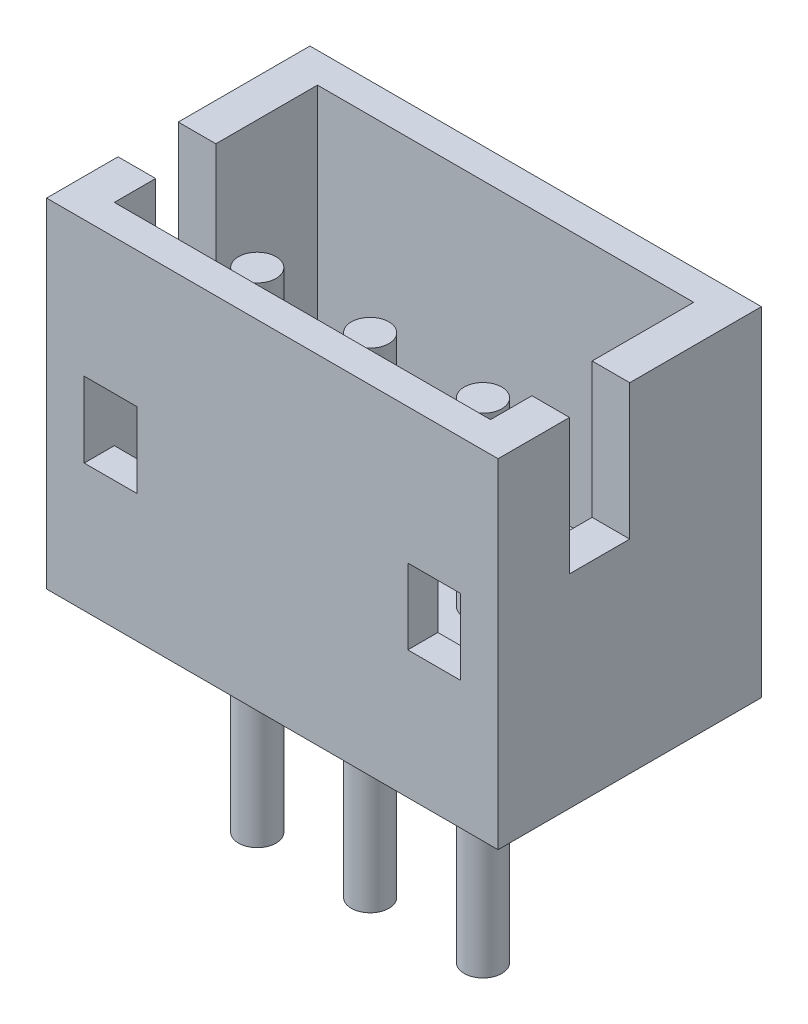
ISO-10303-21;
HEADER;
FILE_DESCRIPTION(('STEP AP214'),'2;1');
FILE_NAME('part.step','',(''),(''),'','','');
FILE_SCHEMA(('AUTOMOTIVE_DESIGN { 1 0 10303 214 1 1 1 1 }'));
ENDSEC;
DATA;
#1=APPLICATION_CONTEXT('core data for automotive mechanical design processes');
#2=APPLICATION_PROTOCOL_DEFINITION('international standard','automotive_design',2000,#1);
#3=PRODUCT_CONTEXT('',#1,'mechanical');
#4=PRODUCT('Part','Part','',(#3));
#5=PRODUCT_RELATED_PRODUCT_CATEGORY('part','',(#4));
#6=PRODUCT_DEFINITION_FORMATION('','',#4);
#7=PRODUCT_DEFINITION_CONTEXT('part definition',#1,'design');
#8=PRODUCT_DEFINITION('design','',#6,#7);
#9=PRODUCT_DEFINITION_SHAPE('','',#8);
#10=(LENGTH_UNIT() NAMED_UNIT(*) SI_UNIT(.MILLI.,.METRE.));
#11=(NAMED_UNIT(*) PLANE_ANGLE_UNIT() SI_UNIT($,.RADIAN.));
#12=(NAMED_UNIT(*) SI_UNIT($,.STERADIAN.) SOLID_ANGLE_UNIT());
#13=UNCERTAINTY_MEASURE_WITH_UNIT(LENGTH_MEASURE(1.E-05),#10,'distance_accuracy_value','');
#14=(GEOMETRIC_REPRESENTATION_CONTEXT(3) GLOBAL_UNCERTAINTY_ASSIGNED_CONTEXT((#13)) GLOBAL_UNIT_ASSIGNED_CONTEXT((#10,
#11,#12)) REPRESENTATION_CONTEXT('',''));
#15=CARTESIAN_POINT('',(0.,0.,0.));
#16=DIRECTION('',(0.,0.,1.));
#17=DIRECTION('',(1.,0.,0.));
#18=AXIS2_PLACEMENT_3D('',#15,#16,#17);
#19=CARTESIAN_POINT('',(1.8,4.5,-0.4));
#20=DIRECTION('',(0.,1.,0.));
#21=DIRECTION('',(0.,0.,1.));
#22=AXIS2_PLACEMENT_3D('',#19,#20,#21);
#23=PLANE('',#22);
#24=DIRECTION('',(-1.,0.,0.));
#25=VECTOR('',#24,1.);
#26=CARTESIAN_POINT('',(3.,4.5,-0.95));
#27=LINE('',#26,#25);
#28=CARTESIAN_POINT('',(-2.5,4.5,-0.95));
#29=VERTEX_POINT('',#28);
#30=CARTESIAN_POINT('',(-3.,4.5,-0.95));
#31=VERTEX_POINT('',#30);
#32=EDGE_CURVE('E210',#29,#31,#27,.T.);
#33=ORIENTED_EDGE('',*,*,#32,.T.);
#34=DIRECTION('',(0.,0.,-1.));
#35=VECTOR('',#34,1.);
#36=CARTESIAN_POINT('',(-3.,4.5,-3.1));
#37=LINE('',#36,#35);
#38=CARTESIAN_POINT('',(-3.,4.5,0.));
#39=VERTEX_POINT('',#38);
#40=EDGE_CURVE('E225',#39,#31,#37,.T.);
#41=ORIENTED_EDGE('',*,*,#40,.F.);
#42=DIRECTION('',(-1.,0.,0.));
#43=VECTOR('',#42,1.);
#44=CARTESIAN_POINT('',(1.8,4.5,0.));
#45=LINE('',#44,#43);
#46=CARTESIAN_POINT('',(3.,4.5,0.));
#47=VERTEX_POINT('',#46);
#48=EDGE_CURVE('E320',#47,#39,#45,.T.);
#49=ORIENTED_EDGE('',*,*,#48,.F.);
#50=DIRECTION('',(0.,0.,1.));
#51=VECTOR('',#50,1.);
#52=CARTESIAN_POINT('',(3.,4.5,0.));
#53=LINE('',#52,#51);
#54=CARTESIAN_POINT('',(3.,4.5,-0.95));
#55=VERTEX_POINT('',#54);
#56=EDGE_CURVE('E266',#55,#47,#53,.T.);
#57=ORIENTED_EDGE('',*,*,#56,.F.);
#58=DIRECTION('',(1.,0.,0.));
#59=VECTOR('',#58,1.);
#60=CARTESIAN_POINT('',(-3.001,4.5,-0.95));
#61=LINE('',#60,#59);
#62=CARTESIAN_POINT('',(2.5,4.5,-0.95));
#63=VERTEX_POINT('',#62);
#64=EDGE_CURVE('E56',#63,#55,#61,.T.);
#65=ORIENTED_EDGE('',*,*,#64,.F.);
#66=DIRECTION('',(0.,0.,1.));
#67=VECTOR('',#66,1.);
#68=CARTESIAN_POINT('',(2.5,4.5,0.));
#69=LINE('',#68,#67);
#70=CARTESIAN_POINT('',(2.5,4.5,-0.400000000000001));
#71=VERTEX_POINT('',#70);
#72=EDGE_CURVE('E274',#63,#71,#69,.T.);
#73=ORIENTED_EDGE('',*,*,#72,.T.);
#74=DIRECTION('',(-1.,0.,0.));
#75=VECTOR('',#74,1.);
#76=CARTESIAN_POINT('',(1.8,4.5,-0.4));
#77=LINE('',#76,#75);
#78=CARTESIAN_POINT('',(-2.5,4.5,-0.4));
#79=VERTEX_POINT('',#78);
#80=EDGE_CURVE('E312',#71,#79,#77,.T.);
#81=ORIENTED_EDGE('',*,*,#80,.T.);
#82=DIRECTION('',(0.,0.,-1.));
#83=VECTOR('',#82,1.);
#84=CARTESIAN_POINT('',(-2.5,4.5,-3.1));
#85=LINE('',#84,#83);
#86=EDGE_CURVE('E228',#79,#29,#85,.T.);
#87=ORIENTED_EDGE('',*,*,#86,.T.);
#88=EDGE_LOOP('',(#33,#41,#49,#57,#65,#73,#81,#87));
#89=FACE_BOUND('',#88,.T.);
#90=ADVANCED_FACE('F33',(#89),#23,.T.);
#91=CARTESIAN_POINT('',(0.,0.,-0.4));
#92=DIRECTION('',(0.,0.,1.));
#93=DIRECTION('',(1.,0.,0.));
#94=AXIS2_PLACEMENT_3D('',#91,#92,#93);
#95=PLANE('',#94);
#96=DIRECTION('',(1.,0.,0.));
#97=VECTOR('',#96,1.);
#98=CARTESIAN_POINT('',(-2.5,1.4,-0.4));
#99=LINE('',#98,#97);
#100=CARTESIAN_POINT('',(-2.5,1.4,-0.4));
#101=VERTEX_POINT('',#100);
#102=CARTESIAN_POINT('',(2.5,1.4,-0.4));
#103=VERTEX_POINT('',#102);
#104=EDGE_CURVE('E427',#101,#103,#99,.T.);
#105=ORIENTED_EDGE('',*,*,#104,.F.);
#106=DIRECTION('',(0.,1.,0.));
#107=VECTOR('',#106,1.);
#108=CARTESIAN_POINT('',(-2.5,1.1,-0.4));
#109=LINE('',#108,#107);
#110=CARTESIAN_POINT('',(-2.5,1.7,-0.4));
#111=VERTEX_POINT('',#110);
#112=EDGE_CURVE('E345',#101,#111,#109,.T.);
#113=ORIENTED_EDGE('',*,*,#112,.T.);
#114=DIRECTION('',(1.,0.,0.));
#115=VECTOR('',#114,1.);
#116=CARTESIAN_POINT('',(-2.5,1.7,-0.4));
#117=LINE('',#116,#115);
#118=CARTESIAN_POINT('',(-1.8,1.7,-0.4));
#119=VERTEX_POINT('',#118);
#120=EDGE_CURVE('E334',#111,#119,#117,.T.);
#121=ORIENTED_EDGE('',*,*,#120,.T.);
#122=DIRECTION('',(0.,-1.,0.));
#123=VECTOR('',#122,1.);
#124=CARTESIAN_POINT('',(-1.8,4.5,-0.4));
#125=LINE('',#124,#123);
#126=CARTESIAN_POINT('',(-1.8,2.7,-0.4));
#127=VERTEX_POINT('',#126);
#128=EDGE_CURVE('E315',#127,#119,#125,.T.);
#129=ORIENTED_EDGE('',*,*,#128,.F.);
#130=DIRECTION('',(1.,0.,0.));
#131=VECTOR('',#130,1.);
#132=CARTESIAN_POINT('',(-2.5,2.7,-0.4));
#133=LINE('',#132,#131);
#134=CARTESIAN_POINT('',(-2.5,2.7,-0.4));
#135=VERTEX_POINT('',#134);
#136=EDGE_CURVE('E301',#135,#127,#133,.T.);
#137=ORIENTED_EDGE('',*,*,#136,.F.);
#138=DIRECTION('',(0.,-1.,0.));
#139=VECTOR('',#138,1.);
#140=CARTESIAN_POINT('',(-2.5,2.7,-0.4));
#141=LINE('',#140,#139);
#142=EDGE_CURVE('E298',#79,#135,#141,.T.);
#143=ORIENTED_EDGE('',*,*,#142,.F.);
#144=ORIENTED_EDGE('',*,*,#80,.F.);
#145=DIRECTION('',(0.,1.,0.));
#146=VECTOR('',#145,1.);
#147=CARTESIAN_POINT('',(2.5,4.5,-0.400000000000001));
#148=LINE('',#147,#146);
#149=CARTESIAN_POINT('',(2.5,2.7,-0.400000000000001));
#150=VERTEX_POINT('',#149);
#151=EDGE_CURVE('E283',#150,#71,#148,.T.);
#152=ORIENTED_EDGE('',*,*,#151,.F.);
#153=DIRECTION('',(-1.,0.,0.));
#154=VECTOR('',#153,1.);
#155=CARTESIAN_POINT('',(2.5,2.7,-0.400000000000001));
#156=LINE('',#155,#154);
#157=CARTESIAN_POINT('',(1.8,2.7,-0.400000000000001));
#158=VERTEX_POINT('',#157);
#159=EDGE_CURVE('E286',#150,#158,#156,.T.);
#160=ORIENTED_EDGE('',*,*,#159,.T.);
#161=DIRECTION('',(0.,1.,0.));
#162=VECTOR('',#161,1.);
#163=CARTESIAN_POINT('',(1.8,1.7,-0.4));
#164=LINE('',#163,#162);
#165=CARTESIAN_POINT('',(1.8,1.7,-0.4));
#166=VERTEX_POINT('',#165);
#167=EDGE_CURVE('E310',#166,#158,#164,.T.);
#168=ORIENTED_EDGE('',*,*,#167,.F.);
#169=CARTESIAN_POINT('',(2.5,1.7,-0.400000000000001));
#170=VERTEX_POINT('',#169);
#171=EDGE_CURVE('E347',#166,#170,#117,.T.);
#172=ORIENTED_EDGE('',*,*,#171,.T.);
#173=DIRECTION('',(0.,1.,0.));
#174=VECTOR('',#173,1.);
#175=CARTESIAN_POINT('',(2.5,1.1,-0.400000000000001));
#176=LINE('',#175,#174);
#177=EDGE_CURVE('E359',#103,#170,#176,.T.);
#178=ORIENTED_EDGE('',*,*,#177,.F.);
#179=EDGE_LOOP('',(#105,#113,#121,#129,#137,#143,#144,#152,#160,#168,#172,#178));
#180=FACE_BOUND('',#179,.T.);
#181=ADVANCED_FACE('F344',(#180),#95,.F.);
#182=CARTESIAN_POINT('',(2.5,0.,0.));
#183=DIRECTION('',(-1.,0.,0.));
#184=DIRECTION('',(0.,-1.,0.));
#185=AXIS2_PLACEMENT_3D('',#182,#183,#184);
#186=PLANE('',#185);
#187=DIRECTION('',(0.,1.,0.));
#188=VECTOR('',#187,1.);
#189=CARTESIAN_POINT('',(2.5,2.69999999999999,-1.75));
#190=LINE('',#189,#188);
#191=CARTESIAN_POINT('',(2.5,2.7,-1.75));
#192=VERTEX_POINT('',#191);
#193=CARTESIAN_POINT('',(2.5,4.5,-1.75));
#194=VERTEX_POINT('',#193);
#195=EDGE_CURVE('E402',#192,#194,#190,.T.);
#196=ORIENTED_EDGE('',*,*,#195,.T.);
#197=CARTESIAN_POINT('',(2.5,4.5,-3.1));
#198=VERTEX_POINT('',#197);
#199=EDGE_CURVE('E275',#198,#194,#69,.T.);
#200=ORIENTED_EDGE('',*,*,#199,.F.);
#201=DIRECTION('',(0.,1.,0.));
#202=VECTOR('',#201,1.);
#203=CARTESIAN_POINT('',(2.5,4.5,-3.1));
#204=LINE('',#203,#202);
#205=CARTESIAN_POINT('',(2.5,1.1,-3.1));
#206=VERTEX_POINT('',#205);
#207=EDGE_CURVE('E271',#206,#198,#204,.T.);
#208=ORIENTED_EDGE('',*,*,#207,.F.);
#209=DIRECTION('',(0.,0.,-1.));
#210=VECTOR('',#209,1.);
#211=CARTESIAN_POINT('',(2.5,1.1,-0.400000000000001));
#212=LINE('',#211,#210);
#213=CARTESIAN_POINT('',(2.5,1.1,-2.05));
#214=VERTEX_POINT('',#213);
#215=EDGE_CURVE('E346',#214,#206,#212,.T.);
#216=ORIENTED_EDGE('',*,*,#215,.F.);
#217=DIRECTION('',(0.,-0.707106781186544,-0.707106781186551));
#218=VECTOR('',#217,1.);
#219=CARTESIAN_POINT('',(2.5,1.1,-2.05));
#220=LINE('',#219,#218);
#221=CARTESIAN_POINT('',(2.5,1.4,-1.75));
#222=VERTEX_POINT('',#221);
#223=EDGE_CURVE('E424',#222,#214,#220,.T.);
#224=ORIENTED_EDGE('',*,*,#223,.F.);
#225=DIRECTION('',(0.,0.,-1.));
#226=VECTOR('',#225,1.);
#227=CARTESIAN_POINT('',(2.5,1.4,-1.75));
#228=LINE('',#227,#226);
#229=EDGE_CURVE('E397',#103,#222,#228,.T.);
#230=ORIENTED_EDGE('',*,*,#229,.F.);
#231=ORIENTED_EDGE('',*,*,#177,.T.);
#232=DIRECTION('',(0.,0.,-1.));
#233=VECTOR('',#232,1.);
#234=CARTESIAN_POINT('',(2.5,1.7,-3.1));
#235=LINE('',#234,#233);
#236=CARTESIAN_POINT('',(2.5,1.7,0.));
#237=VERTEX_POINT('',#236);
#238=EDGE_CURVE('E258',#237,#170,#235,.T.);
#239=ORIENTED_EDGE('',*,*,#238,.F.);
#240=DIRECTION('',(0.,-1.,0.));
#241=VECTOR('',#240,1.);
#242=CARTESIAN_POINT('',(2.5,1.7,0.));
#243=LINE('',#242,#241);
#244=CARTESIAN_POINT('',(2.5,2.7,0.));
#245=VERTEX_POINT('',#244);
#246=EDGE_CURVE('E278',#245,#237,#243,.T.);
#247=ORIENTED_EDGE('',*,*,#246,.F.);
#248=DIRECTION('',(0.,0.,-1.));
#249=VECTOR('',#248,1.);
#250=CARTESIAN_POINT('',(2.5,2.7,-0.400000000000001));
#251=LINE('',#250,#249);
#252=EDGE_CURVE('E280',#245,#150,#251,.T.);
#253=ORIENTED_EDGE('',*,*,#252,.T.);
#254=ORIENTED_EDGE('',*,*,#151,.T.);
#255=ORIENTED_EDGE('',*,*,#72,.F.);
#256=DIRECTION('',(0.,-1.,0.));
#257=VECTOR('',#256,1.);
#258=CARTESIAN_POINT('',(2.5,4.49999999999999,-0.95));
#259=LINE('',#258,#257);
#260=CARTESIAN_POINT('',(2.5,2.7,-0.95));
#261=VERTEX_POINT('',#260);
#262=EDGE_CURVE('E411',#63,#261,#259,.T.);
#263=ORIENTED_EDGE('',*,*,#262,.T.);
#264=DIRECTION('',(0.,0.,-1.));
#265=VECTOR('',#264,1.);
#266=CARTESIAN_POINT('',(2.5,2.7,-0.95));
#267=LINE('',#266,#265);
#268=EDGE_CURVE('E407',#261,#192,#267,.T.);
#269=ORIENTED_EDGE('',*,*,#268,.T.);
#270=EDGE_LOOP('',(#196,#200,#208,#216,#224,#230,#231,#239,#247,#253,#254,#255,#263,#269));
#271=FACE_BOUND('',#270,.T.);
#272=ADVANCED_FACE('F454',(#271),#186,.T.);
#273=CARTESIAN_POINT('',(-2.5,0.,0.));
#274=DIRECTION('',(1.,0.,0.));
#275=DIRECTION('',(0.,0.,-1.));
#276=AXIS2_PLACEMENT_3D('',#273,#274,#275);
#277=PLANE('',#276);
#278=DIRECTION('',(0.,-1.,0.));
#279=VECTOR('',#278,1.);
#280=CARTESIAN_POINT('',(-2.5,0.,-0.95));
#281=LINE('',#280,#279);
#282=CARTESIAN_POINT('',(-2.5,2.7,-0.95));
#283=VERTEX_POINT('',#282);
#284=EDGE_CURVE('E406',#29,#283,#281,.T.);
#285=ORIENTED_EDGE('',*,*,#284,.F.);
#286=ORIENTED_EDGE('',*,*,#86,.F.);
#287=ORIENTED_EDGE('',*,*,#142,.T.);
#288=DIRECTION('',(0.,0.,1.));
#289=VECTOR('',#288,1.);
#290=CARTESIAN_POINT('',(-2.5,2.7,0.));
#291=LINE('',#290,#289);
#292=CARTESIAN_POINT('',(-2.5,2.7,0.));
#293=VERTEX_POINT('',#292);
#294=EDGE_CURVE('E295',#135,#293,#291,.T.);
#295=ORIENTED_EDGE('',*,*,#294,.T.);
#296=DIRECTION('',(0.,1.,0.));
#297=VECTOR('',#296,1.);
#298=CARTESIAN_POINT('',(-2.5,4.5,0.));
#299=LINE('',#298,#297);
#300=CARTESIAN_POINT('',(-2.5,1.7,0.));
#301=VERTEX_POINT('',#300);
#302=EDGE_CURVE('E244',#301,#293,#299,.T.);
#303=ORIENTED_EDGE('',*,*,#302,.F.);
#304=DIRECTION('',(0.,0.,-1.));
#305=VECTOR('',#304,1.);
#306=CARTESIAN_POINT('',(-2.5,1.7,-3.1));
#307=LINE('',#306,#305);
#308=EDGE_CURVE('E257',#301,#111,#307,.T.);
#309=ORIENTED_EDGE('',*,*,#308,.T.);
#310=ORIENTED_EDGE('',*,*,#112,.F.);
#311=DIRECTION('',(0.,0.,-1.));
#312=VECTOR('',#311,1.);
#313=CARTESIAN_POINT('',(-2.5,1.4,-1.75));
#314=LINE('',#313,#312);
#315=CARTESIAN_POINT('',(-2.5,1.4,-1.75));
#316=VERTEX_POINT('',#315);
#317=EDGE_CURVE('E420',#101,#316,#314,.T.);
#318=ORIENTED_EDGE('',*,*,#317,.T.);
#319=DIRECTION('',(0.,-0.707106781186544,-0.707106781186551));
#320=VECTOR('',#319,1.);
#321=CARTESIAN_POINT('',(-2.5,1.1,-2.05));
#322=LINE('',#321,#320);
#323=CARTESIAN_POINT('',(-2.5,1.1,-2.05));
#324=VERTEX_POINT('',#323);
#325=EDGE_CURVE('E423',#316,#324,#322,.T.);
#326=ORIENTED_EDGE('',*,*,#325,.T.);
#327=DIRECTION('',(0.,0.,1.));
#328=VECTOR('',#327,1.);
#329=CARTESIAN_POINT('',(-2.5,1.1,-3.1));
#330=LINE('',#329,#328);
#331=CARTESIAN_POINT('',(-2.5,1.1,-3.1));
#332=VERTEX_POINT('',#331);
#333=EDGE_CURVE('E355',#332,#324,#330,.T.);
#334=ORIENTED_EDGE('',*,*,#333,.F.);
#335=DIRECTION('',(0.,-1.,0.));
#336=VECTOR('',#335,1.);
#337=CARTESIAN_POINT('',(-2.5,0.,-3.1));
#338=LINE('',#337,#336);
#339=CARTESIAN_POINT('',(-2.5,4.5,-3.1));
#340=VERTEX_POINT('',#339);
#341=EDGE_CURVE('E250',#340,#332,#338,.T.);
#342=ORIENTED_EDGE('',*,*,#341,.F.);
#343=CARTESIAN_POINT('',(-2.5,4.5,-1.75));
#344=VERTEX_POINT('',#343);
#345=EDGE_CURVE('E247',#344,#340,#85,.T.);
#346=ORIENTED_EDGE('',*,*,#345,.F.);
#347=DIRECTION('',(0.,1.,0.));
#348=VECTOR('',#347,1.);
#349=CARTESIAN_POINT('',(-2.5,0.,-1.75));
#350=LINE('',#349,#348);
#351=CARTESIAN_POINT('',(-2.5,2.7,-1.75));
#352=VERTEX_POINT('',#351);
#353=EDGE_CURVE('E463',#352,#344,#350,.T.);
#354=ORIENTED_EDGE('',*,*,#353,.F.);
#355=DIRECTION('',(0.,0.,-1.));
#356=VECTOR('',#355,1.);
#357=CARTESIAN_POINT('',(-2.5,2.7,0.));
#358=LINE('',#357,#356);
#359=EDGE_CURVE('E464',#283,#352,#358,.T.);
#360=ORIENTED_EDGE('',*,*,#359,.F.);
#361=EDGE_LOOP('',(#285,#286,#287,#295,#303,#309,#310,#318,#326,#334,#342,#346,#354,#360));
#362=FACE_BOUND('',#361,.T.);
#363=ADVANCED_FACE('F338',(#362),#277,.T.);
#364=CARTESIAN_POINT('',(0.,1.1,0.));
#365=DIRECTION('',(0.,1.,0.));
#366=DIRECTION('',(0.,0.,1.));
#367=AXIS2_PLACEMENT_3D('',#364,#365,#366);
#368=PLANE('',#367);
#369=ORIENTED_EDGE('',*,*,#333,.T.);
#370=DIRECTION('',(1.,0.,0.));
#371=VECTOR('',#370,1.);
#372=CARTESIAN_POINT('',(-2.5,1.1,-2.05));
#373=LINE('',#372,#371);
#374=EDGE_CURVE('E432',#324,#214,#373,.T.);
#375=ORIENTED_EDGE('',*,*,#374,.T.);
#376=ORIENTED_EDGE('',*,*,#215,.T.);
#377=DIRECTION('',(-1.,0.,0.));
#378=VECTOR('',#377,1.);
#379=CARTESIAN_POINT('',(2.5,1.1,-3.1));
#380=LINE('',#379,#378);
#381=EDGE_CURVE('E349',#206,#332,#380,.T.);
#382=ORIENTED_EDGE('',*,*,#381,.T.);
#383=EDGE_LOOP('',(#369,#375,#376,#382));
#384=FACE_BOUND('',#383,.T.);
#385=ADVANCED_FACE('F440',(#384),#368,.T.);
#386=CARTESIAN_POINT('',(0.,1.7,0.));
#387=DIRECTION('',(0.,1.,0.));
#388=DIRECTION('',(0.,0.,1.));
#389=AXIS2_PLACEMENT_3D('',#386,#387,#388);
#390=PLANE('',#389);
#391=ORIENTED_EDGE('',*,*,#120,.F.);
#392=ORIENTED_EDGE('',*,*,#308,.F.);
#393=DIRECTION('',(-1.,0.,0.));
#394=VECTOR('',#393,1.);
#395=CARTESIAN_POINT('',(-2.5,1.7,0.));
#396=LINE('',#395,#394);
#397=CARTESIAN_POINT('',(-1.8,1.7,0.));
#398=VERTEX_POINT('',#397);
#399=EDGE_CURVE('E236',#398,#301,#396,.T.);
#400=ORIENTED_EDGE('',*,*,#399,.F.);
#401=DIRECTION('',(0.,0.,1.));
#402=VECTOR('',#401,1.);
#403=CARTESIAN_POINT('',(-1.8,1.7,-0.4));
#404=LINE('',#403,#402);
#405=EDGE_CURVE('E37',#119,#398,#404,.T.);
#406=ORIENTED_EDGE('',*,*,#405,.F.);
#407=EDGE_LOOP('',(#391,#392,#400,#406));
#408=FACE_BOUND('',#407,.T.);
#409=ADVANCED_FACE('F333',(#408),#390,.T.);
#410=CARTESIAN_POINT('',(1.8,1.7,-0.4));
#411=DIRECTION('',(1.,0.,0.));
#412=DIRECTION('',(0.,1.,0.));
#413=AXIS2_PLACEMENT_3D('',#410,#411,#412);
#414=PLANE('',#413);
#415=DIRECTION('',(0.,0.,-1.));
#416=VECTOR('',#415,1.);
#417=CARTESIAN_POINT('',(1.8,2.7,-0.400000000000001));
#418=LINE('',#417,#416);
#419=CARTESIAN_POINT('',(1.8,2.7,0.));
#420=VERTEX_POINT('',#419);
#421=EDGE_CURVE('E268',#420,#158,#418,.T.);
#422=ORIENTED_EDGE('',*,*,#421,.F.);
#423=DIRECTION('',(0.,1.,0.));
#424=VECTOR('',#423,1.);
#425=CARTESIAN_POINT('',(1.8,1.7,0.));
#426=LINE('',#425,#424);
#427=CARTESIAN_POINT('',(1.8,1.7,0.));
#428=VERTEX_POINT('',#427);
#429=EDGE_CURVE('E309',#428,#420,#426,.T.);
#430=ORIENTED_EDGE('',*,*,#429,.F.);
#431=DIRECTION('',(0.,0.,1.));
#432=VECTOR('',#431,1.);
#433=CARTESIAN_POINT('',(1.8,1.7,-0.4));
#434=LINE('',#433,#432);
#435=EDGE_CURVE('E11',#166,#428,#434,.T.);
#436=ORIENTED_EDGE('',*,*,#435,.F.);
#437=ORIENTED_EDGE('',*,*,#167,.T.);
#438=EDGE_LOOP('',(#422,#430,#436,#437));
#439=FACE_BOUND('',#438,.T.);
#440=ADVANCED_FACE('F35',(#439),#414,.T.);
#441=CARTESIAN_POINT('',(-1.8,4.5,-0.4));
#442=DIRECTION('',(-1.,0.,0.));
#443=DIRECTION('',(0.,-1.,0.));
#444=AXIS2_PLACEMENT_3D('',#441,#442,#443);
#445=PLANE('',#444);
#446=DIRECTION('',(0.,0.,1.));
#447=VECTOR('',#446,1.);
#448=CARTESIAN_POINT('',(-1.8,2.7,0.));
#449=LINE('',#448,#447);
#450=CARTESIAN_POINT('',(-1.8,2.7,0.));
#451=VERTEX_POINT('',#450);
#452=EDGE_CURVE('E294',#127,#451,#449,.T.);
#453=ORIENTED_EDGE('',*,*,#452,.F.);
#454=ORIENTED_EDGE('',*,*,#128,.T.);
#455=ORIENTED_EDGE('',*,*,#405,.T.);
#456=DIRECTION('',(0.,-1.,0.));
#457=VECTOR('',#456,1.);
#458=CARTESIAN_POINT('',(-1.8,4.5,0.));
#459=LINE('',#458,#457);
#460=EDGE_CURVE('E313',#451,#398,#459,.T.);
#461=ORIENTED_EDGE('',*,*,#460,.F.);
#462=EDGE_LOOP('',(#453,#454,#455,#461));
#463=FACE_BOUND('',#462,.T.);
#464=ADVANCED_FACE('F329',(#463),#445,.T.);
#465=DIRECTION('',(-1.,0.,0.));
#466=VECTOR('',#465,1.);
#467=CARTESIAN_POINT('',(3.,4.5,-1.75));
#468=LINE('',#467,#466);
#469=CARTESIAN_POINT('',(-3.,4.5,-1.75));
#470=VERTEX_POINT('',#469);
#471=EDGE_CURVE('E48',#344,#470,#468,.T.);
#472=ORIENTED_EDGE('',*,*,#471,.F.);
#473=ORIENTED_EDGE('',*,*,#345,.T.);
#474=DIRECTION('',(1.,0.,0.));
#475=VECTOR('',#474,1.);
#476=CARTESIAN_POINT('',(3.,4.5,-3.1));
#477=LINE('',#476,#475);
#478=EDGE_CURVE('E358',#340,#198,#477,.T.);
#479=ORIENTED_EDGE('',*,*,#478,.T.);
#480=ORIENTED_EDGE('',*,*,#199,.T.);
#481=DIRECTION('',(1.,0.,0.));
#482=VECTOR('',#481,1.);
#483=CARTESIAN_POINT('',(-3.001,4.5,-1.75));
#484=LINE('',#483,#482);
#485=CARTESIAN_POINT('',(3.,4.5,-1.75));
#486=VERTEX_POINT('',#485);
#487=EDGE_CURVE('E405',#194,#486,#484,.T.);
#488=ORIENTED_EDGE('',*,*,#487,.T.);
#489=CARTESIAN_POINT('',(3.,4.5,-3.5));
#490=VERTEX_POINT('',#489);
#491=EDGE_CURVE('E262',#490,#486,#53,.T.);
#492=ORIENTED_EDGE('',*,*,#491,.F.);
#493=DIRECTION('',(1.,0.,0.));
#494=VECTOR('',#493,1.);
#495=CARTESIAN_POINT('',(3.,4.5,-3.5));
#496=LINE('',#495,#494);
#497=CARTESIAN_POINT('',(-3.,4.5,-3.5));
#498=VERTEX_POINT('',#497);
#499=EDGE_CURVE('E248',#498,#490,#496,.T.);
#500=ORIENTED_EDGE('',*,*,#499,.F.);
#501=EDGE_CURVE('E237',#470,#498,#37,.T.);
#502=ORIENTED_EDGE('',*,*,#501,.F.);
#503=EDGE_LOOP('',(#472,#473,#479,#480,#488,#492,#500,#502));
#504=FACE_BOUND('',#503,.T.);
#505=ADVANCED_FACE('F459',(#504),#23,.T.);
#506=CARTESIAN_POINT('',(0.,0.,0.));
#507=DIRECTION('',(0.,0.,1.));
#508=DIRECTION('',(1.,0.,0.));
#509=AXIS2_PLACEMENT_3D('',#506,#507,#508);
#510=PLANE('',#509);
#511=ORIENTED_EDGE('',*,*,#48,.T.);
#512=DIRECTION('',(0.,1.,0.));
#513=VECTOR('',#512,1.);
#514=CARTESIAN_POINT('',(-3.,4.5,0.));
#515=LINE('',#514,#513);
#516=CARTESIAN_POINT('',(-3.,0.,0.));
#517=VERTEX_POINT('',#516);
#518=EDGE_CURVE('E235',#517,#39,#515,.T.);
#519=ORIENTED_EDGE('',*,*,#518,.F.);
#520=DIRECTION('',(-1.,0.,0.));
#521=VECTOR('',#520,1.);
#522=CARTESIAN_POINT('',(-2.5,0.,0.));
#523=LINE('',#522,#521);
#524=CARTESIAN_POINT('',(3.,0.,0.));
#525=VERTEX_POINT('',#524);
#526=EDGE_CURVE('E256',#525,#517,#523,.T.);
#527=ORIENTED_EDGE('',*,*,#526,.F.);
#528=DIRECTION('',(0.,-1.,0.));
#529=VECTOR('',#528,1.);
#530=CARTESIAN_POINT('',(3.,1.7,0.));
#531=LINE('',#530,#529);
#532=EDGE_CURVE('E265',#47,#525,#531,.T.);
#533=ORIENTED_EDGE('',*,*,#532,.F.);
#534=EDGE_LOOP('',(#511,#519,#527,#533));
#535=FACE_BOUND('',#534,.T.);
#536=EDGE_CURVE('E239',#237,#428,#396,.T.);
#537=ORIENTED_EDGE('',*,*,#536,.T.);
#538=ORIENTED_EDGE('',*,*,#429,.T.);
#539=DIRECTION('',(-1.,0.,0.));
#540=VECTOR('',#539,1.);
#541=CARTESIAN_POINT('',(2.5,2.7,0.));
#542=LINE('',#541,#540);
#543=EDGE_CURVE('E291',#245,#420,#542,.T.);
#544=ORIENTED_EDGE('',*,*,#543,.F.);
#545=ORIENTED_EDGE('',*,*,#246,.T.);
#546=EDGE_LOOP('',(#537,#538,#544,#545));
#547=FACE_BOUND('',#546,.T.);
#548=ORIENTED_EDGE('',*,*,#460,.T.);
#549=ORIENTED_EDGE('',*,*,#399,.T.);
#550=ORIENTED_EDGE('',*,*,#302,.T.);
#551=DIRECTION('',(1.,0.,0.));
#552=VECTOR('',#551,1.);
#553=CARTESIAN_POINT('',(-2.5,2.7,0.));
#554=LINE('',#553,#552);
#555=EDGE_CURVE('E306',#293,#451,#554,.T.);
#556=ORIENTED_EDGE('',*,*,#555,.T.);
#557=EDGE_LOOP('',(#548,#549,#550,#556));
#558=FACE_BOUND('',#557,.T.);
#559=ADVANCED_FACE('F325',(#535,#547,#558),#510,.T.);
#560=CARTESIAN_POINT('',(-2.5,2.7,0.));
#561=DIRECTION('',(0.,1.,0.));
#562=DIRECTION('',(-1.,0.,0.));
#563=AXIS2_PLACEMENT_3D('',#560,#561,#562);
#564=PLANE('',#563);
#565=ORIENTED_EDGE('',*,*,#452,.T.);
#566=ORIENTED_EDGE('',*,*,#555,.F.);
#567=ORIENTED_EDGE('',*,*,#294,.F.);
#568=ORIENTED_EDGE('',*,*,#136,.T.);
#569=EDGE_LOOP('',(#565,#566,#567,#568));
#570=FACE_BOUND('',#569,.T.);
#571=ADVANCED_FACE('F341',(#570),#564,.F.);
#572=CARTESIAN_POINT('',(2.5,2.7,-0.400000000000001));
#573=DIRECTION('',(0.,1.,0.));
#574=DIRECTION('',(0.,0.,1.));
#575=AXIS2_PLACEMENT_3D('',#572,#573,#574);
#576=PLANE('',#575);
#577=ORIENTED_EDGE('',*,*,#421,.T.);
#578=ORIENTED_EDGE('',*,*,#159,.F.);
#579=ORIENTED_EDGE('',*,*,#252,.F.);
#580=ORIENTED_EDGE('',*,*,#543,.T.);
#581=EDGE_LOOP('',(#577,#578,#579,#580));
#582=FACE_BOUND('',#581,.T.);
#583=ADVANCED_FACE('F545',(#582),#576,.F.);
#584=CARTESIAN_POINT('',(3.,0.,0.));
#585=DIRECTION('',(-1.,0.,0.));
#586=DIRECTION('',(0.,-1.,0.));
#587=AXIS2_PLACEMENT_3D('',#584,#585,#586);
#588=PLANE('',#587);
#589=ORIENTED_EDGE('',*,*,#491,.T.);
#590=DIRECTION('',(0.,1.,0.));
#591=VECTOR('',#590,1.);
#592=CARTESIAN_POINT('',(3.,2.7,-1.75));
#593=LINE('',#592,#591);
#594=CARTESIAN_POINT('',(3.,2.7,-1.75));
#595=VERTEX_POINT('',#594);
#596=EDGE_CURVE('E395',#595,#486,#593,.T.);
#597=ORIENTED_EDGE('',*,*,#596,.F.);
#598=DIRECTION('',(0.,0.,-1.));
#599=VECTOR('',#598,1.);
#600=CARTESIAN_POINT('',(3.,2.7,-0.95));
#601=LINE('',#600,#599);
#602=CARTESIAN_POINT('',(3.,2.7,-0.95));
#603=VERTEX_POINT('',#602);
#604=EDGE_CURVE('E393',#603,#595,#601,.T.);
#605=ORIENTED_EDGE('',*,*,#604,.F.);
#606=DIRECTION('',(0.,-1.,0.));
#607=VECTOR('',#606,1.);
#608=CARTESIAN_POINT('',(3.,4.5,-0.95));
#609=LINE('',#608,#607);
#610=EDGE_CURVE('E391',#55,#603,#609,.T.);
#611=ORIENTED_EDGE('',*,*,#610,.F.);
#612=ORIENTED_EDGE('',*,*,#56,.T.);
#613=ORIENTED_EDGE('',*,*,#532,.T.);
#614=DIRECTION('',(0.,0.,1.));
#615=VECTOR('',#614,1.);
#616=CARTESIAN_POINT('',(3.,0.,0.));
#617=LINE('',#616,#615);
#618=CARTESIAN_POINT('',(3.,0.,-3.5));
#619=VERTEX_POINT('',#618);
#620=EDGE_CURVE('E253',#619,#525,#617,.T.);
#621=ORIENTED_EDGE('',*,*,#620,.F.);
#622=DIRECTION('',(0.,-1.,0.));
#623=VECTOR('',#622,1.);
#624=CARTESIAN_POINT('',(3.,0.,-3.5));
#625=LINE('',#624,#623);
#626=EDGE_CURVE('E361',#490,#619,#625,.T.);
#627=ORIENTED_EDGE('',*,*,#626,.F.);
#628=EDGE_LOOP('',(#589,#597,#605,#611,#612,#613,#621,#627));
#629=FACE_BOUND('',#628,.T.);
#630=ADVANCED_FACE('F383',(#629),#588,.F.);
#631=CARTESIAN_POINT('',(0.,0.,0.));
#632=DIRECTION('',(0.,1.,0.));
#633=DIRECTION('',(0.,0.,1.));
#634=AXIS2_PLACEMENT_3D('',#631,#632,#633);
#635=PLANE('',#634);
#636=CARTESIAN_POINT('',(1.5,0.,-1.3));
#637=DIRECTION('',(0.,1.,0.));
#638=DIRECTION('',(0.,0.,1.));
#639=AXIS2_PLACEMENT_3D('',#636,#637,#638);
#640=CIRCLE('',#639,0.25);
#641=CARTESIAN_POINT('',(1.5,0.,-1.05));
#642=VERTEX_POINT('',#641);
#643=EDGE_CURVE('E489',#642,#642,#640,.T.);
#644=ORIENTED_EDGE('',*,*,#643,.T.);
#645=EDGE_LOOP('',(#644));
#646=FACE_BOUND('',#645,.T.);
#647=CARTESIAN_POINT('',(0.,0.,-1.3));
#648=DIRECTION('',(0.,1.,0.));
#649=DIRECTION('',(0.,0.,1.));
#650=AXIS2_PLACEMENT_3D('',#647,#648,#649);
#651=CIRCLE('',#650,0.25);
#652=CARTESIAN_POINT('',(0.,0.,-1.05));
#653=VERTEX_POINT('',#652);
#654=EDGE_CURVE('E483',#653,#653,#651,.T.);
#655=ORIENTED_EDGE('',*,*,#654,.T.);
#656=EDGE_LOOP('',(#655));
#657=FACE_BOUND('',#656,.T.);
#658=CARTESIAN_POINT('',(-1.5,0.,-1.3));
#659=DIRECTION('',(0.,1.,0.));
#660=DIRECTION('',(-1.,0.,0.));
#661=AXIS2_PLACEMENT_3D('',#658,#659,#660);
#662=CIRCLE('',#661,0.25);
#663=CARTESIAN_POINT('',(-1.75,0.,-1.3));
#664=VERTEX_POINT('',#663);
#665=EDGE_CURVE('E477',#664,#664,#662,.T.);
#666=ORIENTED_EDGE('',*,*,#665,.T.);
#667=EDGE_LOOP('',(#666));
#668=FACE_BOUND('',#667,.T.);
#669=DIRECTION('',(0.,0.,1.));
#670=VECTOR('',#669,1.);
#671=CARTESIAN_POINT('',(-3.,0.,0.));
#672=LINE('',#671,#670);
#673=CARTESIAN_POINT('',(-3.,0.,-3.5));
#674=VERTEX_POINT('',#673);
#675=EDGE_CURVE('E252',#674,#517,#672,.T.);
#676=ORIENTED_EDGE('',*,*,#675,.F.);
#677=DIRECTION('',(-1.,0.,0.));
#678=VECTOR('',#677,1.);
#679=CARTESIAN_POINT('',(-3.,0.,-3.5));
#680=LINE('',#679,#678);
#681=EDGE_CURVE('E364',#619,#674,#680,.T.);
#682=ORIENTED_EDGE('',*,*,#681,.F.);
#683=ORIENTED_EDGE('',*,*,#620,.T.);
#684=ORIENTED_EDGE('',*,*,#526,.T.);
#685=EDGE_LOOP('',(#676,#682,#683,#684));
#686=FACE_BOUND('',#685,.T.);
#687=ADVANCED_FACE('F376',(#646,#657,#668,#686),#635,.F.);
#688=ORIENTED_EDGE('',*,*,#171,.F.);
#689=ORIENTED_EDGE('',*,*,#435,.T.);
#690=ORIENTED_EDGE('',*,*,#536,.F.);
#691=ORIENTED_EDGE('',*,*,#238,.T.);
#692=EDGE_LOOP('',(#688,#689,#690,#691));
#693=FACE_BOUND('',#692,.T.);
#694=ADVANCED_FACE('F553',(#693),#390,.T.);
#695=CARTESIAN_POINT('',(-3.,0.,0.));
#696=DIRECTION('',(1.,0.,0.));
#697=DIRECTION('',(0.,0.,-1.));
#698=AXIS2_PLACEMENT_3D('',#695,#696,#697);
#699=PLANE('',#698);
#700=ORIENTED_EDGE('',*,*,#40,.T.);
#701=DIRECTION('',(0.,1.,0.));
#702=VECTOR('',#701,1.);
#703=CARTESIAN_POINT('',(-3.,2.7,-0.95));
#704=LINE('',#703,#702);
#705=CARTESIAN_POINT('',(-3.,2.7,-0.95));
#706=VERTEX_POINT('',#705);
#707=EDGE_CURVE('E207',#706,#31,#704,.T.);
#708=ORIENTED_EDGE('',*,*,#707,.F.);
#709=DIRECTION('',(0.,0.,1.));
#710=VECTOR('',#709,1.);
#711=CARTESIAN_POINT('',(-3.,2.7,-1.75));
#712=LINE('',#711,#710);
#713=CARTESIAN_POINT('',(-3.,2.7,-1.75));
#714=VERTEX_POINT('',#713);
#715=EDGE_CURVE('E229',#714,#706,#712,.T.);
#716=ORIENTED_EDGE('',*,*,#715,.F.);
#717=DIRECTION('',(0.,-1.,0.));
#718=VECTOR('',#717,1.);
#719=CARTESIAN_POINT('',(-3.,4.5,-1.75));
#720=LINE('',#719,#718);
#721=EDGE_CURVE('E218',#470,#714,#720,.T.);
#722=ORIENTED_EDGE('',*,*,#721,.F.);
#723=ORIENTED_EDGE('',*,*,#501,.T.);
#724=DIRECTION('',(0.,1.,0.));
#725=VECTOR('',#724,1.);
#726=CARTESIAN_POINT('',(-3.,4.5,-3.5));
#727=LINE('',#726,#725);
#728=EDGE_CURVE('E367',#674,#498,#727,.T.);
#729=ORIENTED_EDGE('',*,*,#728,.F.);
#730=ORIENTED_EDGE('',*,*,#675,.T.);
#731=ORIENTED_EDGE('',*,*,#518,.T.);
#732=EDGE_LOOP('',(#700,#708,#716,#722,#723,#729,#730,#731));
#733=FACE_BOUND('',#732,.T.);
#734=ADVANCED_FACE('F232',(#733),#699,.F.);
#735=CARTESIAN_POINT('',(0.,0.,-3.5));
#736=DIRECTION('',(0.,0.,1.));
#737=DIRECTION('',(0.,-1.,0.));
#738=AXIS2_PLACEMENT_3D('',#735,#736,#737);
#739=PLANE('',#738);
#740=ORIENTED_EDGE('',*,*,#626,.T.);
#741=ORIENTED_EDGE('',*,*,#681,.T.);
#742=ORIENTED_EDGE('',*,*,#728,.T.);
#743=ORIENTED_EDGE('',*,*,#499,.T.);
#744=EDGE_LOOP('',(#740,#741,#742,#743));
#745=FACE_BOUND('',#744,.T.);
#746=ADVANCED_FACE('F379',(#745),#739,.F.);
#747=CARTESIAN_POINT('',(0.,0.,-3.1));
#748=DIRECTION('',(0.,0.,1.));
#749=DIRECTION('',(0.,-1.,0.));
#750=AXIS2_PLACEMENT_3D('',#747,#748,#749);
#751=PLANE('',#750);
#752=ORIENTED_EDGE('',*,*,#341,.T.);
#753=ORIENTED_EDGE('',*,*,#381,.F.);
#754=ORIENTED_EDGE('',*,*,#207,.T.);
#755=ORIENTED_EDGE('',*,*,#478,.F.);
#756=EDGE_LOOP('',(#752,#753,#754,#755));
#757=FACE_BOUND('',#756,.T.);
#758=ADVANCED_FACE('F457',(#757),#751,.T.);
#759=CARTESIAN_POINT('',(-2.5,1.4,-1.75));
#760=DIRECTION('',(0.,-1.,0.));
#761=DIRECTION('',(0.,0.,-1.));
#762=AXIS2_PLACEMENT_3D('',#759,#760,#761);
#763=PLANE('',#762);
#764=CARTESIAN_POINT('',(-1.5,1.4,-1.3));
#765=DIRECTION('',(0.,1.,0.));
#766=DIRECTION('',(0.,0.,1.));
#767=AXIS2_PLACEMENT_3D('',#764,#765,#766);
#768=CIRCLE('',#767,0.25);
#769=CARTESIAN_POINT('',(-1.5,1.4,-1.05));
#770=VERTEX_POINT('',#769);
#771=EDGE_CURVE('E504',#770,#770,#768,.T.);
#772=ORIENTED_EDGE('',*,*,#771,.F.);
#773=EDGE_LOOP('',(#772));
#774=FACE_BOUND('',#773,.T.);
#775=CARTESIAN_POINT('',(0.,1.4,-1.3));
#776=DIRECTION('',(0.,1.,0.));
#777=DIRECTION('',(0.,0.,1.));
#778=AXIS2_PLACEMENT_3D('',#775,#776,#777);
#779=CIRCLE('',#778,0.25);
#780=CARTESIAN_POINT('',(0.,1.4,-1.05));
#781=VERTEX_POINT('',#780);
#782=EDGE_CURVE('E498',#781,#781,#779,.T.);
#783=ORIENTED_EDGE('',*,*,#782,.F.);
#784=EDGE_LOOP('',(#783));
#785=FACE_BOUND('',#784,.T.);
#786=CARTESIAN_POINT('',(1.5,1.4,-1.3));
#787=DIRECTION('',(0.,1.,0.));
#788=DIRECTION('',(0.,0.,1.));
#789=AXIS2_PLACEMENT_3D('',#786,#787,#788);
#790=CIRCLE('',#789,0.25);
#791=CARTESIAN_POINT('',(1.5,1.4,-1.05));
#792=VERTEX_POINT('',#791);
#793=EDGE_CURVE('E492',#792,#792,#790,.T.);
#794=ORIENTED_EDGE('',*,*,#793,.F.);
#795=EDGE_LOOP('',(#794));
#796=FACE_BOUND('',#795,.T.);
#797=ORIENTED_EDGE('',*,*,#229,.T.);
#798=DIRECTION('',(1.,0.,0.));
#799=VECTOR('',#798,1.);
#800=CARTESIAN_POINT('',(-2.5,1.4,-1.75));
#801=LINE('',#800,#799);
#802=EDGE_CURVE('E352',#316,#222,#801,.T.);
#803=ORIENTED_EDGE('',*,*,#802,.F.);
#804=ORIENTED_EDGE('',*,*,#317,.F.);
#805=ORIENTED_EDGE('',*,*,#104,.T.);
#806=EDGE_LOOP('',(#797,#803,#804,#805));
#807=FACE_BOUND('',#806,.T.);
#808=ADVANCED_FACE('F449',(#774,#785,#796,#807),#763,.F.);
#809=CARTESIAN_POINT('',(-2.5,1.1,-2.05));
#810=DIRECTION('',(0.,-0.707106781186551,0.707106781186544));
#811=DIRECTION('',(0.,-0.707106781186544,-0.707106781186551));
#812=AXIS2_PLACEMENT_3D('',#809,#810,#811);
#813=PLANE('',#812);
#814=ORIENTED_EDGE('',*,*,#223,.T.);
#815=ORIENTED_EDGE('',*,*,#374,.F.);
#816=ORIENTED_EDGE('',*,*,#325,.F.);
#817=ORIENTED_EDGE('',*,*,#802,.T.);
#818=EDGE_LOOP('',(#814,#815,#816,#817));
#819=FACE_BOUND('',#818,.T.);
#820=ADVANCED_FACE('F447',(#819),#813,.F.);
#821=CARTESIAN_POINT('',(-3.001,2.7,-1.75));
#822=DIRECTION('',(0.,0.,-1.));
#823=DIRECTION('',(-1.,0.,0.));
#824=AXIS2_PLACEMENT_3D('',#821,#822,#823);
#825=PLANE('',#824);
#826=DIRECTION('',(1.,0.,0.));
#827=VECTOR('',#826,1.);
#828=CARTESIAN_POINT('',(-3.001,2.7,-1.75));
#829=LINE('',#828,#827);
#830=EDGE_CURVE('E410',#192,#595,#829,.T.);
#831=ORIENTED_EDGE('',*,*,#830,.T.);
#832=ORIENTED_EDGE('',*,*,#596,.T.);
#833=ORIENTED_EDGE('',*,*,#487,.F.);
#834=ORIENTED_EDGE('',*,*,#195,.F.);
#835=EDGE_LOOP('',(#831,#832,#833,#834));
#836=FACE_BOUND('',#835,.T.);
#837=ADVANCED_FACE('F575',(#836),#825,.F.);
#838=CARTESIAN_POINT('',(-3.001,2.7,-0.95));
#839=DIRECTION('',(0.,-1.,0.));
#840=DIRECTION('',(0.,0.,-1.));
#841=AXIS2_PLACEMENT_3D('',#838,#839,#840);
#842=PLANE('',#841);
#843=DIRECTION('',(1.,0.,0.));
#844=VECTOR('',#843,1.);
#845=CARTESIAN_POINT('',(-3.001,2.7,-0.95));
#846=LINE('',#845,#844);
#847=EDGE_CURVE('E414',#261,#603,#846,.T.);
#848=ORIENTED_EDGE('',*,*,#847,.T.);
#849=ORIENTED_EDGE('',*,*,#604,.T.);
#850=ORIENTED_EDGE('',*,*,#830,.F.);
#851=ORIENTED_EDGE('',*,*,#268,.F.);
#852=EDGE_LOOP('',(#848,#849,#850,#851));
#853=FACE_BOUND('',#852,.T.);
#854=ADVANCED_FACE('F578',(#853),#842,.F.);
#855=CARTESIAN_POINT('',(-3.001,4.5,-0.95));
#856=DIRECTION('',(0.,0.,1.));
#857=DIRECTION('',(0.,-1.,0.));
#858=AXIS2_PLACEMENT_3D('',#855,#856,#857);
#859=PLANE('',#858);
#860=ORIENTED_EDGE('',*,*,#64,.T.);
#861=ORIENTED_EDGE('',*,*,#610,.T.);
#862=ORIENTED_EDGE('',*,*,#847,.F.);
#863=ORIENTED_EDGE('',*,*,#262,.F.);
#864=EDGE_LOOP('',(#860,#861,#862,#863));
#865=FACE_BOUND('',#864,.T.);
#866=ADVANCED_FACE('F582',(#865),#859,.F.);
#867=CARTESIAN_POINT('',(3.,2.7,-0.95));
#868=DIRECTION('',(0.,0.,1.));
#869=DIRECTION('',(0.,-1.,0.));
#870=AXIS2_PLACEMENT_3D('',#867,#868,#869);
#871=PLANE('',#870);
#872=ORIENTED_EDGE('',*,*,#284,.T.);
#873=DIRECTION('',(-1.,0.,0.));
#874=VECTOR('',#873,1.);
#875=CARTESIAN_POINT('',(3.,2.7,-0.95));
#876=LINE('',#875,#874);
#877=EDGE_CURVE('E213',#283,#706,#876,.T.);
#878=ORIENTED_EDGE('',*,*,#877,.T.);
#879=ORIENTED_EDGE('',*,*,#707,.T.);
#880=ORIENTED_EDGE('',*,*,#32,.F.);
#881=EDGE_LOOP('',(#872,#878,#879,#880));
#882=FACE_BOUND('',#881,.T.);
#883=ADVANCED_FACE('F209',(#882),#871,.F.);
#884=CARTESIAN_POINT('',(3.,2.7,-1.75));
#885=DIRECTION('',(0.,-1.,0.));
#886=DIRECTION('',(0.,0.,-1.));
#887=AXIS2_PLACEMENT_3D('',#884,#885,#886);
#888=PLANE('',#887);
#889=ORIENTED_EDGE('',*,*,#359,.T.);
#890=DIRECTION('',(-1.,0.,0.));
#891=VECTOR('',#890,1.);
#892=CARTESIAN_POINT('',(3.,2.7,-1.75));
#893=LINE('',#892,#891);
#894=EDGE_CURVE('E470',#352,#714,#893,.T.);
#895=ORIENTED_EDGE('',*,*,#894,.T.);
#896=ORIENTED_EDGE('',*,*,#715,.T.);
#897=ORIENTED_EDGE('',*,*,#877,.F.);
#898=EDGE_LOOP('',(#889,#895,#896,#897));
#899=FACE_BOUND('',#898,.T.);
#900=ADVANCED_FACE('F588',(#899),#888,.F.);
#901=CARTESIAN_POINT('',(3.,4.5,-1.75));
#902=DIRECTION('',(0.,0.,-1.));
#903=DIRECTION('',(-1.,0.,0.));
#904=AXIS2_PLACEMENT_3D('',#901,#902,#903);
#905=PLANE('',#904);
#906=ORIENTED_EDGE('',*,*,#353,.T.);
#907=ORIENTED_EDGE('',*,*,#471,.T.);
#908=ORIENTED_EDGE('',*,*,#721,.T.);
#909=ORIENTED_EDGE('',*,*,#894,.F.);
#910=EDGE_LOOP('',(#906,#907,#908,#909));
#911=FACE_BOUND('',#910,.T.);
#912=ADVANCED_FACE('F589',(#911),#905,.F.);
#913=CARTESIAN_POINT('',(-1.5,-2.7,-1.3));
#914=DIRECTION('',(0.,1.,0.));
#915=DIRECTION('',(-1.,0.,0.));
#916=AXIS2_PLACEMENT_3D('',#913,#914,#915);
#917=CYLINDRICAL_SURFACE('',#916,0.25);
#918=CARTESIAN_POINT('',(-1.5,-2.7,-1.3));
#919=DIRECTION('',(0.,1.,0.));
#920=DIRECTION('',(-1.,0.,0.));
#921=AXIS2_PLACEMENT_3D('',#918,#919,#920);
#922=CIRCLE('',#921,0.25);
#923=CARTESIAN_POINT('',(-1.75,-2.7,-1.3));
#924=VERTEX_POINT('',#923);
#925=EDGE_CURVE('E219',#924,#924,#922,.T.);
#926=ORIENTED_EDGE('',*,*,#925,.T.);
#927=EDGE_LOOP('',(#926));
#928=FACE_BOUND('',#927,.T.);
#929=ORIENTED_EDGE('',*,*,#665,.F.);
#930=EDGE_LOOP('',(#929));
#931=FACE_BOUND('',#930,.T.);
#932=ADVANCED_FACE('F592',(#928,#931),#917,.T.);
#933=CARTESIAN_POINT('',(-1.25,-2.7,-1.3));
#934=DIRECTION('',(0.,-1.,0.));
#935=DIRECTION('',(1.,0.,0.));
#936=AXIS2_PLACEMENT_3D('',#933,#934,#935);
#937=PLANE('',#936);
#938=ORIENTED_EDGE('',*,*,#925,.F.);
#939=EDGE_LOOP('',(#938));
#940=FACE_BOUND('',#939,.T.);
#941=ADVANCED_FACE('F598',(#940),#937,.T.);
#942=CARTESIAN_POINT('',(0.,-2.7,-1.3));
#943=DIRECTION('',(0.,1.,0.));
#944=DIRECTION('',(0.,0.,1.));
#945=AXIS2_PLACEMENT_3D('',#942,#943,#944);
#946=CYLINDRICAL_SURFACE('',#945,0.25);
#947=CARTESIAN_POINT('',(0.,-2.7,-1.3));
#948=DIRECTION('',(0.,1.,0.));
#949=DIRECTION('',(0.,0.,1.));
#950=AXIS2_PLACEMENT_3D('',#947,#948,#949);
#951=CIRCLE('',#950,0.25);
#952=CARTESIAN_POINT('',(0.,-2.7,-1.05));
#953=VERTEX_POINT('',#952);
#954=EDGE_CURVE('E480',#953,#953,#951,.T.);
#955=ORIENTED_EDGE('',*,*,#954,.T.);
#956=EDGE_LOOP('',(#955));
#957=FACE_BOUND('',#956,.T.);
#958=ORIENTED_EDGE('',*,*,#654,.F.);
#959=EDGE_LOOP('',(#958));
#960=FACE_BOUND('',#959,.T.);
#961=ADVANCED_FACE('F602',(#957,#960),#946,.T.);
#962=CARTESIAN_POINT('',(0.25,-2.7,-1.3));
#963=DIRECTION('',(0.,-1.,0.));
#964=DIRECTION('',(0.,0.,-1.));
#965=AXIS2_PLACEMENT_3D('',#962,#963,#964);
#966=PLANE('',#965);
#967=ORIENTED_EDGE('',*,*,#954,.F.);
#968=EDGE_LOOP('',(#967));
#969=FACE_BOUND('',#968,.T.);
#970=ADVANCED_FACE('F606',(#969),#966,.T.);
#971=CARTESIAN_POINT('',(1.5,-2.7,-1.3));
#972=DIRECTION('',(0.,1.,0.));
#973=DIRECTION('',(0.,0.,1.));
#974=AXIS2_PLACEMENT_3D('',#971,#972,#973);
#975=CYLINDRICAL_SURFACE('',#974,0.25);
#976=CARTESIAN_POINT('',(1.5,-2.7,-1.3));
#977=DIRECTION('',(0.,1.,0.));
#978=DIRECTION('',(0.,0.,1.));
#979=AXIS2_PLACEMENT_3D('',#976,#977,#978);
#980=CIRCLE('',#979,0.25);
#981=CARTESIAN_POINT('',(1.5,-2.7,-1.05));
#982=VERTEX_POINT('',#981);
#983=EDGE_CURVE('E486',#982,#982,#980,.T.);
#984=ORIENTED_EDGE('',*,*,#983,.T.);
#985=EDGE_LOOP('',(#984));
#986=FACE_BOUND('',#985,.T.);
#987=ORIENTED_EDGE('',*,*,#643,.F.);
#988=EDGE_LOOP('',(#987));
#989=FACE_BOUND('',#988,.T.);
#990=ADVANCED_FACE('F610',(#986,#989),#975,.T.);
#991=CARTESIAN_POINT('',(1.75,-2.7,-1.3));
#992=DIRECTION('',(0.,-1.,0.));
#993=DIRECTION('',(0.,0.,-1.));
#994=AXIS2_PLACEMENT_3D('',#991,#992,#993);
#995=PLANE('',#994);
#996=ORIENTED_EDGE('',*,*,#983,.F.);
#997=EDGE_LOOP('',(#996));
#998=FACE_BOUND('',#997,.T.);
#999=ADVANCED_FACE('F614',(#998),#995,.T.);
#1000=CARTESIAN_POINT('',(1.5,1.4,-1.3));
#1001=DIRECTION('',(0.,1.,0.));
#1002=DIRECTION('',(0.,0.,1.));
#1003=AXIS2_PLACEMENT_3D('',#1000,#1001,#1002);
#1004=CYLINDRICAL_SURFACE('',#1003,0.25);
#1005=ORIENTED_EDGE('',*,*,#793,.T.);
#1006=EDGE_LOOP('',(#1005));
#1007=FACE_BOUND('',#1006,.T.);
#1008=CARTESIAN_POINT('',(1.5,3.8,-1.3));
#1009=DIRECTION('',(0.,1.,0.));
#1010=DIRECTION('',(0.,0.,1.));
#1011=AXIS2_PLACEMENT_3D('',#1008,#1009,#1010);
#1012=CIRCLE('',#1011,0.25);
#1013=CARTESIAN_POINT('',(1.5,3.8,-1.05));
#1014=VERTEX_POINT('',#1013);
#1015=EDGE_CURVE('E495',#1014,#1014,#1012,.T.);
#1016=ORIENTED_EDGE('',*,*,#1015,.F.);
#1017=EDGE_LOOP('',(#1016));
#1018=FACE_BOUND('',#1017,.T.);
#1019=ADVANCED_FACE('F618',(#1007,#1018),#1004,.T.);
#1020=CARTESIAN_POINT('',(1.5,3.8,-1.3));
#1021=DIRECTION('',(0.,1.,0.));
#1022=DIRECTION('',(0.,0.,1.));
#1023=AXIS2_PLACEMENT_3D('',#1020,#1021,#1022);
#1024=PLANE('',#1023);
#1025=ORIENTED_EDGE('',*,*,#1015,.T.);
#1026=EDGE_LOOP('',(#1025));
#1027=FACE_BOUND('',#1026,.T.);
#1028=ADVANCED_FACE('F622',(#1027),#1024,.T.);
#1029=CARTESIAN_POINT('',(0.,1.4,-1.3));
#1030=DIRECTION('',(0.,1.,0.));
#1031=DIRECTION('',(0.,0.,1.));
#1032=AXIS2_PLACEMENT_3D('',#1029,#1030,#1031);
#1033=CYLINDRICAL_SURFACE('',#1032,0.25);
#1034=ORIENTED_EDGE('',*,*,#782,.T.);
#1035=EDGE_LOOP('',(#1034));
#1036=FACE_BOUND('',#1035,.T.);
#1037=CARTESIAN_POINT('',(0.,3.8,-1.3));
#1038=DIRECTION('',(0.,1.,0.));
#1039=DIRECTION('',(0.,0.,1.));
#1040=AXIS2_PLACEMENT_3D('',#1037,#1038,#1039);
#1041=CIRCLE('',#1040,0.25);
#1042=CARTESIAN_POINT('',(0.,3.8,-1.05));
#1043=VERTEX_POINT('',#1042);
#1044=EDGE_CURVE('E501',#1043,#1043,#1041,.T.);
#1045=ORIENTED_EDGE('',*,*,#1044,.F.);
#1046=EDGE_LOOP('',(#1045));
#1047=FACE_BOUND('',#1046,.T.);
#1048=ADVANCED_FACE('F523',(#1036,#1047),#1033,.T.);
#1049=CARTESIAN_POINT('',(0.,3.8,-1.3));
#1050=DIRECTION('',(0.,1.,0.));
#1051=DIRECTION('',(0.,0.,1.));
#1052=AXIS2_PLACEMENT_3D('',#1049,#1050,#1051);
#1053=PLANE('',#1052);
#1054=ORIENTED_EDGE('',*,*,#1044,.T.);
#1055=EDGE_LOOP('',(#1054));
#1056=FACE_BOUND('',#1055,.T.);
#1057=ADVANCED_FACE('F515',(#1056),#1053,.T.);
#1058=CARTESIAN_POINT('',(-1.5,1.4,-1.3));
#1059=DIRECTION('',(0.,1.,0.));
#1060=DIRECTION('',(0.,0.,1.));
#1061=AXIS2_PLACEMENT_3D('',#1058,#1059,#1060);
#1062=CYLINDRICAL_SURFACE('',#1061,0.25);
#1063=ORIENTED_EDGE('',*,*,#771,.T.);
#1064=EDGE_LOOP('',(#1063));
#1065=FACE_BOUND('',#1064,.T.);
#1066=CARTESIAN_POINT('',(-1.5,3.8,-1.3));
#1067=DIRECTION('',(0.,1.,0.));
#1068=DIRECTION('',(0.,0.,1.));
#1069=AXIS2_PLACEMENT_3D('',#1066,#1067,#1068);
#1070=CIRCLE('',#1069,0.25);
#1071=CARTESIAN_POINT('',(-1.5,3.8,-1.05));
#1072=VERTEX_POINT('',#1071);
#1073=EDGE_CURVE('E507',#1072,#1072,#1070,.T.);
#1074=ORIENTED_EDGE('',*,*,#1073,.F.);
#1075=EDGE_LOOP('',(#1074));
#1076=FACE_BOUND('',#1075,.T.);
#1077=ADVANCED_FACE('F513',(#1065,#1076),#1062,.T.);
#1078=CARTESIAN_POINT('',(-1.5,3.8,-1.3));
#1079=DIRECTION('',(0.,1.,0.));
#1080=DIRECTION('',(0.,0.,1.));
#1081=AXIS2_PLACEMENT_3D('',#1078,#1079,#1080);
#1082=PLANE('',#1081);
#1083=ORIENTED_EDGE('',*,*,#1073,.T.);
#1084=EDGE_LOOP('',(#1083));
#1085=FACE_BOUND('',#1084,.T.);
#1086=ADVANCED_FACE('F511',(#1085),#1082,.T.);
#1087=CLOSED_SHELL('',(#90,#181,#272,#363,#385,#409,#440,#464,#505,#559,#571,#583,#630,#687,
#694,#734,#746,#758,#808,#820,#837,#854,#866,#883,#900,#912,#932,#941,#961,#970,#990,#999,#1019,
#1028,#1048,#1057,#1077,#1086));
#1088=MANIFOLD_SOLID_BREP('B2',#1087);
#1089=ADVANCED_BREP_SHAPE_REPRESENTATION('',(#18,#1088),#14);
#1090=SHAPE_DEFINITION_REPRESENTATION(#9,#1089);
ENDSEC;
END-ISO-10303-21;
